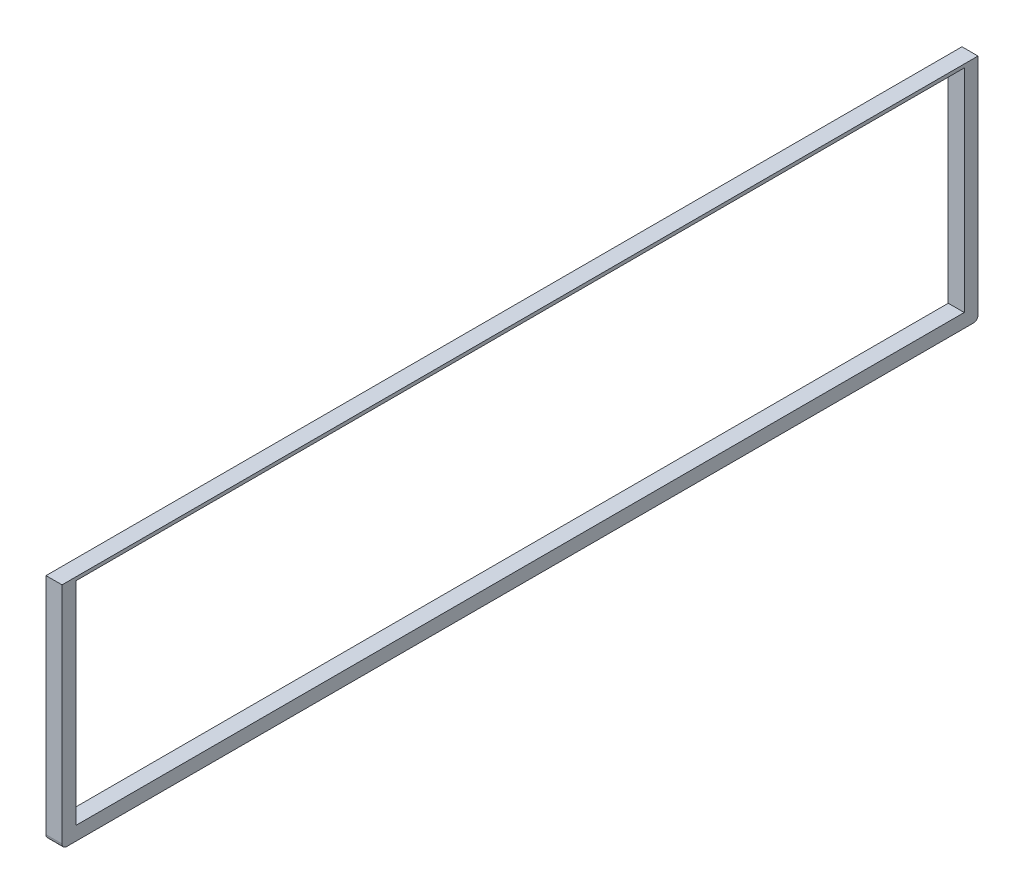
ISO-10303-21;
HEADER;
FILE_DESCRIPTION(('STEP AP214'),'2;1');
FILE_NAME('part.step','',(''),(''),'','','');
FILE_SCHEMA(('AUTOMOTIVE_DESIGN { 1 0 10303 214 1 1 1 1 }'));
ENDSEC;
DATA;
#1=APPLICATION_CONTEXT('core data for automotive mechanical design processes');
#2=APPLICATION_PROTOCOL_DEFINITION('international standard','automotive_design',2000,#1);
#3=PRODUCT_CONTEXT('',#1,'mechanical');
#4=PRODUCT('Part','Part','',(#3));
#5=PRODUCT_RELATED_PRODUCT_CATEGORY('part','',(#4));
#6=PRODUCT_DEFINITION_FORMATION('','',#4);
#7=PRODUCT_DEFINITION_CONTEXT('part definition',#1,'design');
#8=PRODUCT_DEFINITION('design','',#6,#7);
#9=PRODUCT_DEFINITION_SHAPE('','',#8);
#10=(LENGTH_UNIT() NAMED_UNIT(*) SI_UNIT(.MILLI.,.METRE.));
#11=(NAMED_UNIT(*) PLANE_ANGLE_UNIT() SI_UNIT($,.RADIAN.));
#12=(NAMED_UNIT(*) SI_UNIT($,.STERADIAN.) SOLID_ANGLE_UNIT());
#13=UNCERTAINTY_MEASURE_WITH_UNIT(LENGTH_MEASURE(1.E-05),#10,'distance_accuracy_value','');
#14=(GEOMETRIC_REPRESENTATION_CONTEXT(3) GLOBAL_UNCERTAINTY_ASSIGNED_CONTEXT((#13)) GLOBAL_UNIT_ASSIGNED_CONTEXT((#10,
#11,#12)) REPRESENTATION_CONTEXT('',''));
#15=CARTESIAN_POINT('',(0.,0.,0.));
#16=DIRECTION('',(0.,0.,1.));
#17=DIRECTION('',(1.,0.,0.));
#18=AXIS2_PLACEMENT_3D('',#15,#16,#17);
#19=CARTESIAN_POINT('',(35.,-913.463280399258,-299.014097575395));
#20=DIRECTION('',(0.,0.,1.));
#21=DIRECTION('',(0.,-1.,0.));
#22=AXIS2_PLACEMENT_3D('',#19,#20,#21);
#23=PLANE('',#22);
#24=DIRECTION('',(0.,1.,0.));
#25=VECTOR('',#24,1.);
#26=CARTESIAN_POINT('',(35.,-913.463280399258,-299.014097575395));
#27=LINE('',#26,#25);
#28=CARTESIAN_POINT('',(35.,-1403.46328039926,-299.014097575395));
#29=VERTEX_POINT('',#28);
#30=CARTESIAN_POINT('',(35.,-913.463280399258,-299.014097575395));
#31=VERTEX_POINT('',#30);
#32=EDGE_CURVE('E181',#29,#31,#27,.T.);
#33=ORIENTED_EDGE('',*,*,#32,.F.);
#34=DIRECTION('',(-1.,0.,0.));
#35=VECTOR('',#34,1.);
#36=CARTESIAN_POINT('',(35.,-1403.46328039926,-299.014097575395));
#37=LINE('',#36,#35);
#38=CARTESIAN_POINT('',(0.,-1403.46328039926,-299.014097575395));
#39=VERTEX_POINT('',#38);
#40=EDGE_CURVE('E212',#29,#39,#37,.T.);
#41=ORIENTED_EDGE('',*,*,#40,.T.);
#42=DIRECTION('',(0.,1.,0.));
#43=VECTOR('',#42,1.);
#44=CARTESIAN_POINT('',(0.,-913.463280399258,-299.014097575395));
#45=LINE('',#44,#43);
#46=CARTESIAN_POINT('',(0.,-913.463280399258,-299.014097575395));
#47=VERTEX_POINT('',#46);
#48=EDGE_CURVE('E175',#39,#47,#45,.T.);
#49=ORIENTED_EDGE('',*,*,#48,.T.);
#50=DIRECTION('',(-1.,0.,0.));
#51=VECTOR('',#50,1.);
#52=CARTESIAN_POINT('',(35.,-913.463280399258,-299.014097575395));
#53=LINE('',#52,#51);
#54=EDGE_CURVE('E208',#31,#47,#53,.T.);
#55=ORIENTED_EDGE('',*,*,#54,.F.);
#56=EDGE_LOOP('',(#33,#41,#49,#55));
#57=FACE_BOUND('',#56,.T.);
#58=ADVANCED_FACE('F45',(#57),#23,.F.);
#59=CARTESIAN_POINT('',(35.,-913.463280399258,1700.98590242461));
#60=DIRECTION('',(0.,-1.,0.));
#61=DIRECTION('',(0.,0.,-1.));
#62=AXIS2_PLACEMENT_3D('',#59,#60,#61);
#63=PLANE('',#62);
#64=DIRECTION('',(0.,0.,1.));
#65=VECTOR('',#64,1.);
#66=CARTESIAN_POINT('',(0.,-913.463280399258,1700.98590242461));
#67=LINE('',#66,#65);
#68=CARTESIAN_POINT('',(0.,-913.463280399258,1700.98590242461));
#69=VERTEX_POINT('',#68);
#70=EDGE_CURVE('E197',#47,#69,#67,.T.);
#71=ORIENTED_EDGE('',*,*,#70,.T.);
#72=DIRECTION('',(-1.,0.,0.));
#73=VECTOR('',#72,1.);
#74=CARTESIAN_POINT('',(35.,-913.463280399258,1700.98590242461));
#75=LINE('',#74,#73);
#76=CARTESIAN_POINT('',(35.,-913.463280399258,1700.98590242461));
#77=VERTEX_POINT('',#76);
#78=EDGE_CURVE('E194',#77,#69,#75,.T.);
#79=ORIENTED_EDGE('',*,*,#78,.F.);
#80=DIRECTION('',(0.,0.,1.));
#81=VECTOR('',#80,1.);
#82=CARTESIAN_POINT('',(35.,-913.463280399258,1700.98590242461));
#83=LINE('',#82,#81);
#84=EDGE_CURVE('E184',#31,#77,#83,.T.);
#85=ORIENTED_EDGE('',*,*,#84,.F.);
#86=ORIENTED_EDGE('',*,*,#54,.T.);
#87=EDGE_LOOP('',(#71,#79,#85,#86));
#88=FACE_BOUND('',#87,.T.);
#89=ADVANCED_FACE('F252',(#88),#63,.F.);
#90=CARTESIAN_POINT('',(35.,-913.463280399258,1700.98590242461));
#91=DIRECTION('',(0.,0.,-1.));
#92=DIRECTION('',(0.,1.,0.));
#93=AXIS2_PLACEMENT_3D('',#90,#91,#92);
#94=PLANE('',#93);
#95=DIRECTION('',(0.,-1.,0.));
#96=VECTOR('',#95,1.);
#97=CARTESIAN_POINT('',(0.,-913.463280399258,1700.98590242461));
#98=LINE('',#97,#96);
#99=CARTESIAN_POINT('',(0.,-1403.46328039926,1700.9859024246));
#100=VERTEX_POINT('',#99);
#101=EDGE_CURVE('E200',#69,#100,#98,.T.);
#102=ORIENTED_EDGE('',*,*,#101,.T.);
#103=DIRECTION('',(-1.,0.,0.));
#104=VECTOR('',#103,1.);
#105=CARTESIAN_POINT('',(35.,-1403.46328039926,1700.9859024246));
#106=LINE('',#105,#104);
#107=CARTESIAN_POINT('',(35.,-1403.46328039926,1700.9859024246));
#108=VERTEX_POINT('',#107);
#109=EDGE_CURVE('E11',#100,#108,#106,.F.);
#110=ORIENTED_EDGE('',*,*,#109,.T.);
#111=DIRECTION('',(0.,-1.,0.));
#112=VECTOR('',#111,1.);
#113=CARTESIAN_POINT('',(35.,-913.463280399258,1700.98590242461));
#114=LINE('',#113,#112);
#115=EDGE_CURVE('E188',#77,#108,#114,.T.);
#116=ORIENTED_EDGE('',*,*,#115,.F.);
#117=ORIENTED_EDGE('',*,*,#78,.T.);
#118=EDGE_LOOP('',(#102,#110,#116,#117));
#119=FACE_BOUND('',#118,.T.);
#120=ADVANCED_FACE('F249',(#119),#94,.F.);
#121=CARTESIAN_POINT('',(35.,-1413.46328039926,1700.9859024246));
#122=DIRECTION('',(0.,1.,0.));
#123=DIRECTION('',(0.,0.,1.));
#124=AXIS2_PLACEMENT_3D('',#121,#122,#123);
#125=PLANE('',#124);
#126=DIRECTION('',(0.,0.,-1.));
#127=VECTOR('',#126,1.);
#128=CARTESIAN_POINT('',(0.,-1413.46328039926,1700.9859024246));
#129=LINE('',#128,#127);
#130=CARTESIAN_POINT('',(0.,-1413.46328039926,1690.9859024246));
#131=VERTEX_POINT('',#130);
#132=CARTESIAN_POINT('',(0.,-1413.46328039926,-289.014097575395));
#133=VERTEX_POINT('',#132);
#134=EDGE_CURVE('E185',#131,#133,#129,.T.);
#135=ORIENTED_EDGE('',*,*,#134,.T.);
#136=DIRECTION('',(-1.,0.,0.));
#137=VECTOR('',#136,1.);
#138=CARTESIAN_POINT('',(35.,-1413.46328039926,-289.014097575395));
#139=LINE('',#138,#137);
#140=CARTESIAN_POINT('',(35.,-1413.46328039926,-289.014097575395));
#141=VERTEX_POINT('',#140);
#142=EDGE_CURVE('E67',#133,#141,#139,.F.);
#143=ORIENTED_EDGE('',*,*,#142,.T.);
#144=DIRECTION('',(0.,0.,-1.));
#145=VECTOR('',#144,1.);
#146=CARTESIAN_POINT('',(35.,-1413.46328039926,1700.9859024246));
#147=LINE('',#146,#145);
#148=CARTESIAN_POINT('',(35.,-1413.46328039926,1690.9859024246));
#149=VERTEX_POINT('',#148);
#150=EDGE_CURVE('E191',#149,#141,#147,.T.);
#151=ORIENTED_EDGE('',*,*,#150,.F.);
#152=DIRECTION('',(-1.,0.,0.));
#153=VECTOR('',#152,1.);
#154=CARTESIAN_POINT('',(35.,-1413.46328039926,1690.9859024246));
#155=LINE('',#154,#153);
#156=EDGE_CURVE('E222',#149,#131,#155,.T.);
#157=ORIENTED_EDGE('',*,*,#156,.T.);
#158=EDGE_LOOP('',(#135,#143,#151,#157));
#159=FACE_BOUND('',#158,.T.);
#160=ADVANCED_FACE('F244',(#159),#125,.F.);
#161=CARTESIAN_POINT('',(35.,0.,0.));
#162=DIRECTION('',(1.,0.,0.));
#163=DIRECTION('',(0.,0.,-1.));
#164=AXIS2_PLACEMENT_3D('',#161,#162,#163);
#165=PLANE('',#164);
#166=DIRECTION('',(0.,1.,0.));
#167=VECTOR('',#166,1.);
#168=CARTESIAN_POINT('',(35.,-1383.46328039926,-269.014097575395));
#169=LINE('',#168,#167);
#170=CARTESIAN_POINT('',(35.,-1383.46328039926,-269.014097575395));
#171=VERTEX_POINT('',#170);
#172=CARTESIAN_POINT('',(35.,-920.963280399258,-269.014097575395));
#173=VERTEX_POINT('',#172);
#174=EDGE_CURVE('E132',#171,#173,#169,.T.);
#175=ORIENTED_EDGE('',*,*,#174,.F.);
#176=DIRECTION('',(0.,0.,-1.));
#177=VECTOR('',#176,1.);
#178=CARTESIAN_POINT('',(35.,-1383.46328039926,1670.98590242461));
#179=LINE('',#178,#177);
#180=CARTESIAN_POINT('',(35.,-1383.46328039926,1670.98590242461));
#181=VERTEX_POINT('',#180);
#182=EDGE_CURVE('E153',#181,#171,#179,.T.);
#183=ORIENTED_EDGE('',*,*,#182,.F.);
#184=DIRECTION('',(0.,-1.,0.));
#185=VECTOR('',#184,1.);
#186=CARTESIAN_POINT('',(35.,-920.963280399258,1670.98590242461));
#187=LINE('',#186,#185);
#188=CARTESIAN_POINT('',(35.,-920.963280399258,1670.98590242461));
#189=VERTEX_POINT('',#188);
#190=EDGE_CURVE('E157',#189,#181,#187,.T.);
#191=ORIENTED_EDGE('',*,*,#190,.F.);
#192=DIRECTION('',(0.,0.,1.));
#193=VECTOR('',#192,1.);
#194=CARTESIAN_POINT('',(35.,-920.963280399258,1670.98590242461));
#195=LINE('',#194,#193);
#196=EDGE_CURVE('E166',#173,#189,#195,.T.);
#197=ORIENTED_EDGE('',*,*,#196,.F.);
#198=EDGE_LOOP('',(#175,#183,#191,#197));
#199=FACE_BOUND('',#198,.T.);
#200=ORIENTED_EDGE('',*,*,#150,.T.);
#201=CARTESIAN_POINT('',(35.,-1403.46328039926,-289.014097575395));
#202=DIRECTION('',(1.,0.,0.));
#203=DIRECTION('',(0.,0.,-1.));
#204=AXIS2_PLACEMENT_3D('',#201,#202,#203);
#205=CIRCLE('',#204,10.);
#206=EDGE_CURVE('E54',#141,#29,#205,.T.);
#207=ORIENTED_EDGE('',*,*,#206,.T.);
#208=ORIENTED_EDGE('',*,*,#32,.T.);
#209=ORIENTED_EDGE('',*,*,#84,.T.);
#210=ORIENTED_EDGE('',*,*,#115,.T.);
#211=CARTESIAN_POINT('',(35.,-1403.46328039926,1690.9859024246));
#212=DIRECTION('',(1.,0.,0.));
#213=DIRECTION('',(0.,0.,-1.));
#214=AXIS2_PLACEMENT_3D('',#211,#212,#213);
#215=CIRCLE('',#214,10.);
#216=EDGE_CURVE('E228',#108,#149,#215,.T.);
#217=ORIENTED_EDGE('',*,*,#216,.T.);
#218=EDGE_LOOP('',(#200,#207,#208,#209,#210,#217));
#219=FACE_BOUND('',#218,.T.);
#220=ADVANCED_FACE('F234',(#199,#219),#165,.T.);
#221=CARTESIAN_POINT('',(0.,0.,0.));
#222=DIRECTION('',(1.,0.,0.));
#223=DIRECTION('',(0.,0.,-1.));
#224=AXIS2_PLACEMENT_3D('',#221,#222,#223);
#225=PLANE('',#224);
#226=DIRECTION('',(0.,0.,-1.));
#227=VECTOR('',#226,1.);
#228=CARTESIAN_POINT('',(0.,-1383.46328039926,1670.98590242461));
#229=LINE('',#228,#227);
#230=CARTESIAN_POINT('',(0.,-1383.46328039926,1670.98590242461));
#231=VERTEX_POINT('',#230);
#232=CARTESIAN_POINT('',(0.,-1383.46328039926,-269.014097575395));
#233=VERTEX_POINT('',#232);
#234=EDGE_CURVE('E138',#231,#233,#229,.T.);
#235=ORIENTED_EDGE('',*,*,#234,.T.);
#236=DIRECTION('',(0.,1.,0.));
#237=VECTOR('',#236,1.);
#238=CARTESIAN_POINT('',(0.,-1383.46328039926,-269.014097575395));
#239=LINE('',#238,#237);
#240=CARTESIAN_POINT('',(0.,-920.963280399258,-269.014097575395));
#241=VERTEX_POINT('',#240);
#242=EDGE_CURVE('E129',#233,#241,#239,.T.);
#243=ORIENTED_EDGE('',*,*,#242,.T.);
#244=DIRECTION('',(0.,0.,1.));
#245=VECTOR('',#244,1.);
#246=CARTESIAN_POINT('',(0.,-920.963280399258,1670.98590242461));
#247=LINE('',#246,#245);
#248=CARTESIAN_POINT('',(0.,-920.963280399258,1670.98590242461));
#249=VERTEX_POINT('',#248);
#250=EDGE_CURVE('E142',#241,#249,#247,.T.);
#251=ORIENTED_EDGE('',*,*,#250,.T.);
#252=DIRECTION('',(0.,-1.,0.));
#253=VECTOR('',#252,1.);
#254=CARTESIAN_POINT('',(0.,-920.963280399258,1670.98590242461));
#255=LINE('',#254,#253);
#256=EDGE_CURVE('E147',#249,#231,#255,.T.);
#257=ORIENTED_EDGE('',*,*,#256,.T.);
#258=EDGE_LOOP('',(#235,#243,#251,#257));
#259=FACE_BOUND('',#258,.T.);
#260=ORIENTED_EDGE('',*,*,#48,.F.);
#261=CARTESIAN_POINT('',(0.,-1403.46328039926,-289.014097575395));
#262=DIRECTION('',(1.,0.,0.));
#263=DIRECTION('',(0.,0.,-1.));
#264=AXIS2_PLACEMENT_3D('',#261,#262,#263);
#265=CIRCLE('',#264,10.);
#266=EDGE_CURVE('E219',#39,#133,#265,.F.);
#267=ORIENTED_EDGE('',*,*,#266,.T.);
#268=ORIENTED_EDGE('',*,*,#134,.F.);
#269=CARTESIAN_POINT('',(0.,-1403.46328039926,1690.9859024246));
#270=DIRECTION('',(1.,0.,0.));
#271=DIRECTION('',(0.,0.,-1.));
#272=AXIS2_PLACEMENT_3D('',#269,#270,#271);
#273=CIRCLE('',#272,10.);
#274=EDGE_CURVE('E216',#131,#100,#273,.F.);
#275=ORIENTED_EDGE('',*,*,#274,.T.);
#276=ORIENTED_EDGE('',*,*,#101,.F.);
#277=ORIENTED_EDGE('',*,*,#70,.F.);
#278=EDGE_LOOP('',(#260,#267,#268,#275,#276,#277));
#279=FACE_BOUND('',#278,.T.);
#280=ADVANCED_FACE('F149',(#259,#279),#225,.F.);
#281=CARTESIAN_POINT('',(0.,-1383.46328039926,-269.014097575395));
#282=DIRECTION('',(0.,0.,-1.));
#283=DIRECTION('',(-1.,0.,0.));
#284=AXIS2_PLACEMENT_3D('',#281,#282,#283);
#285=PLANE('',#284);
#286=ORIENTED_EDGE('',*,*,#174,.T.);
#287=DIRECTION('',(1.,0.,0.));
#288=VECTOR('',#287,1.);
#289=CARTESIAN_POINT('',(0.,-920.963280399258,-269.014097575395));
#290=LINE('',#289,#288);
#291=EDGE_CURVE('E125',#241,#173,#290,.T.);
#292=ORIENTED_EDGE('',*,*,#291,.F.);
#293=ORIENTED_EDGE('',*,*,#242,.F.);
#294=DIRECTION('',(1.,0.,0.));
#295=VECTOR('',#294,1.);
#296=CARTESIAN_POINT('',(0.,-1383.46328039926,-269.014097575395));
#297=LINE('',#296,#295);
#298=EDGE_CURVE('E172',#233,#171,#297,.T.);
#299=ORIENTED_EDGE('',*,*,#298,.T.);
#300=EDGE_LOOP('',(#286,#292,#293,#299));
#301=FACE_BOUND('',#300,.T.);
#302=ADVANCED_FACE('F127',(#301),#285,.F.);
#303=CARTESIAN_POINT('',(0.,-1383.46328039926,1670.98590242461));
#304=DIRECTION('',(0.,-1.,0.));
#305=DIRECTION('',(0.,0.,-1.));
#306=AXIS2_PLACEMENT_3D('',#303,#304,#305);
#307=PLANE('',#306);
#308=ORIENTED_EDGE('',*,*,#182,.T.);
#309=ORIENTED_EDGE('',*,*,#298,.F.);
#310=ORIENTED_EDGE('',*,*,#234,.F.);
#311=DIRECTION('',(1.,0.,0.));
#312=VECTOR('',#311,1.);
#313=CARTESIAN_POINT('',(0.,-1383.46328039926,1670.98590242461));
#314=LINE('',#313,#312);
#315=EDGE_CURVE('E176',#231,#181,#314,.T.);
#316=ORIENTED_EDGE('',*,*,#315,.T.);
#317=EDGE_LOOP('',(#308,#309,#310,#316));
#318=FACE_BOUND('',#317,.T.);
#319=ADVANCED_FACE('F272',(#318),#307,.F.);
#320=CARTESIAN_POINT('',(0.,-920.963280399258,1670.98590242461));
#321=DIRECTION('',(0.,0.,1.));
#322=DIRECTION('',(1.,0.,0.));
#323=AXIS2_PLACEMENT_3D('',#320,#321,#322);
#324=PLANE('',#323);
#325=ORIENTED_EDGE('',*,*,#190,.T.);
#326=ORIENTED_EDGE('',*,*,#315,.F.);
#327=ORIENTED_EDGE('',*,*,#256,.F.);
#328=DIRECTION('',(1.,0.,0.));
#329=VECTOR('',#328,1.);
#330=CARTESIAN_POINT('',(0.,-920.963280399258,1670.98590242461));
#331=LINE('',#330,#329);
#332=EDGE_CURVE('E137',#249,#189,#331,.T.);
#333=ORIENTED_EDGE('',*,*,#332,.T.);
#334=EDGE_LOOP('',(#325,#326,#327,#333));
#335=FACE_BOUND('',#334,.T.);
#336=ADVANCED_FACE('F267',(#335),#324,.F.);
#337=CARTESIAN_POINT('',(0.,-920.963280399258,1670.98590242461));
#338=DIRECTION('',(0.,1.,0.));
#339=DIRECTION('',(0.,0.,1.));
#340=AXIS2_PLACEMENT_3D('',#337,#338,#339);
#341=PLANE('',#340);
#342=ORIENTED_EDGE('',*,*,#196,.T.);
#343=ORIENTED_EDGE('',*,*,#332,.F.);
#344=ORIENTED_EDGE('',*,*,#250,.F.);
#345=ORIENTED_EDGE('',*,*,#291,.T.);
#346=EDGE_LOOP('',(#342,#343,#344,#345));
#347=FACE_BOUND('',#346,.T.);
#348=ADVANCED_FACE('F143',(#347),#341,.F.);
#349=CARTESIAN_POINT('',(35.,-1403.46328039926,-289.014097575395));
#350=DIRECTION('',(-1.,0.,0.));
#351=DIRECTION('',(0.,0.,1.));
#352=AXIS2_PLACEMENT_3D('',#349,#350,#351);
#353=CYLINDRICAL_SURFACE('',#352,10.);
#354=ORIENTED_EDGE('',*,*,#206,.F.);
#355=ORIENTED_EDGE('',*,*,#142,.F.);
#356=ORIENTED_EDGE('',*,*,#266,.F.);
#357=ORIENTED_EDGE('',*,*,#40,.F.);
#358=EDGE_LOOP('',(#354,#355,#356,#357));
#359=FACE_BOUND('',#358,.T.);
#360=ADVANCED_FACE('F241',(#359),#353,.T.);
#361=CARTESIAN_POINT('',(35.,-1403.46328039926,1690.9859024246));
#362=DIRECTION('',(-1.,0.,0.));
#363=DIRECTION('',(0.,0.,1.));
#364=AXIS2_PLACEMENT_3D('',#361,#362,#363);
#365=CYLINDRICAL_SURFACE('',#364,10.);
#366=ORIENTED_EDGE('',*,*,#216,.F.);
#367=ORIENTED_EDGE('',*,*,#109,.F.);
#368=ORIENTED_EDGE('',*,*,#274,.F.);
#369=ORIENTED_EDGE('',*,*,#156,.F.);
#370=EDGE_LOOP('',(#366,#367,#368,#369));
#371=FACE_BOUND('',#370,.T.);
#372=ADVANCED_FACE('F47',(#371),#365,.T.);
#373=CLOSED_SHELL('',(#58,#89,#120,#160,#220,#280,#302,#319,#336,#348,#360,#372));
#374=MANIFOLD_SOLID_BREP('B2',#373);
#375=ADVANCED_BREP_SHAPE_REPRESENTATION('',(#18,#374),#14);
#376=SHAPE_DEFINITION_REPRESENTATION(#9,#375);
ENDSEC;
END-ISO-10303-21;
